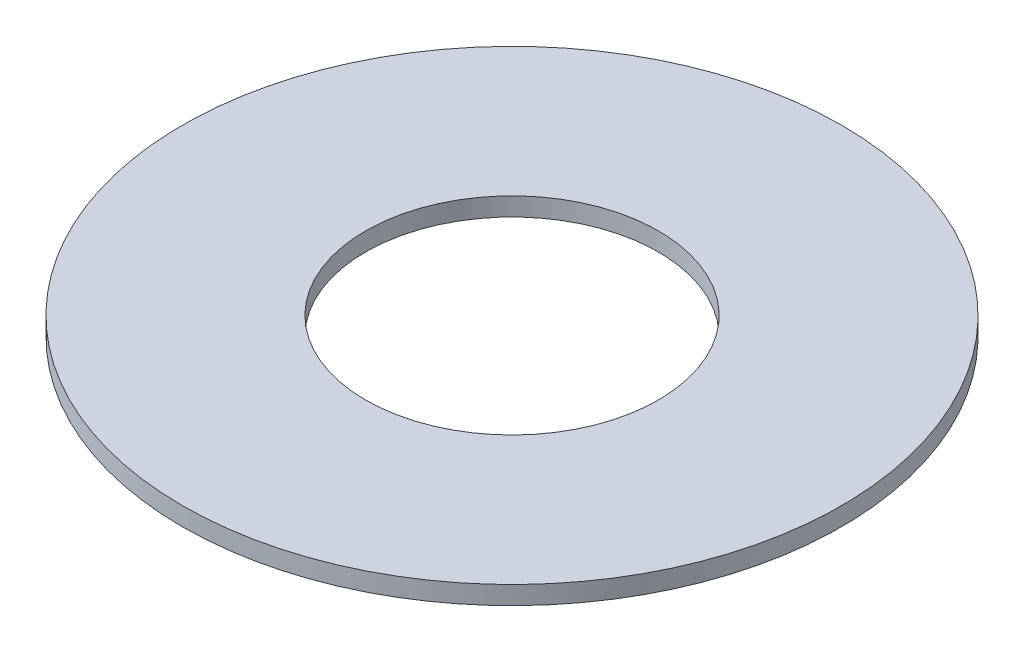
ISO-10303-21;
HEADER;
FILE_DESCRIPTION(('STEP AP214'),'2;1');
FILE_NAME('part.step','',(''),(''),'','','');
FILE_SCHEMA(('AUTOMOTIVE_DESIGN { 1 0 10303 214 1 1 1 1 }'));
ENDSEC;
DATA;
#1=APPLICATION_CONTEXT('core data for automotive mechanical design processes');
#2=APPLICATION_PROTOCOL_DEFINITION('international standard','automotive_design',2000,#1);
#3=PRODUCT_CONTEXT('',#1,'mechanical');
#4=PRODUCT('Part','Part','',(#3));
#5=PRODUCT_RELATED_PRODUCT_CATEGORY('part','',(#4));
#6=PRODUCT_DEFINITION_FORMATION('','',#4);
#7=PRODUCT_DEFINITION_CONTEXT('part definition',#1,'design');
#8=PRODUCT_DEFINITION('design','',#6,#7);
#9=PRODUCT_DEFINITION_SHAPE('','',#8);
#10=(LENGTH_UNIT() NAMED_UNIT(*) SI_UNIT(.MILLI.,.METRE.));
#11=(NAMED_UNIT(*) PLANE_ANGLE_UNIT() SI_UNIT($,.RADIAN.));
#12=(NAMED_UNIT(*) SI_UNIT($,.STERADIAN.) SOLID_ANGLE_UNIT());
#13=UNCERTAINTY_MEASURE_WITH_UNIT(LENGTH_MEASURE(1.E-05),#10,'distance_accuracy_value','');
#14=(GEOMETRIC_REPRESENTATION_CONTEXT(3) GLOBAL_UNCERTAINTY_ASSIGNED_CONTEXT((#13)) GLOBAL_UNIT_ASSIGNED_CONTEXT((#10,
#11,#12)) REPRESENTATION_CONTEXT('',''));
#15=CARTESIAN_POINT('',(0.,0.,0.));
#16=DIRECTION('',(0.,0.,1.));
#17=DIRECTION('',(1.,0.,0.));
#18=AXIS2_PLACEMENT_3D('',#15,#16,#17);
#19=CARTESIAN_POINT('',(0.,0.5,0.));
#20=DIRECTION('',(0.,1.,0.));
#21=DIRECTION('',(0.,0.,1.));
#22=AXIS2_PLACEMENT_3D('',#19,#20,#21);
#23=PLANE('',#22);
#24=CARTESIAN_POINT('',(0.,0.5,0.));
#25=DIRECTION('',(0.,1.,0.));
#26=DIRECTION('',(0.,0.,1.));
#27=AXIS2_PLACEMENT_3D('',#24,#25,#26);
#28=CIRCLE('',#27,9.);
#29=CARTESIAN_POINT('',(0.,0.5,9.));
#30=VERTEX_POINT('',#29);
#31=EDGE_CURVE('E10',#30,#30,#28,.T.);
#32=ORIENTED_EDGE('',*,*,#31,.T.);
#33=EDGE_LOOP('',(#32));
#34=FACE_BOUND('',#33,.T.);
#35=CARTESIAN_POINT('',(0.,0.5,0.));
#36=DIRECTION('',(0.,1.,0.));
#37=DIRECTION('',(0.,0.,1.));
#38=AXIS2_PLACEMENT_3D('',#35,#36,#37);
#39=CIRCLE('',#38,4.);
#40=CARTESIAN_POINT('',(0.,0.5,4.));
#41=VERTEX_POINT('',#40);
#42=EDGE_CURVE('E46',#41,#41,#39,.T.);
#43=ORIENTED_EDGE('',*,*,#42,.F.);
#44=EDGE_LOOP('',(#43));
#45=FACE_BOUND('',#44,.T.);
#46=ADVANCED_FACE('F35',(#34,#45),#23,.T.);
#47=CARTESIAN_POINT('',(0.,0.,0.));
#48=DIRECTION('',(0.,1.,0.));
#49=DIRECTION('',(0.,0.,1.));
#50=AXIS2_PLACEMENT_3D('',#47,#48,#49);
#51=PLANE('',#50);
#52=CARTESIAN_POINT('',(0.,0.,0.));
#53=DIRECTION('',(0.,1.,0.));
#54=DIRECTION('',(0.,0.,1.));
#55=AXIS2_PLACEMENT_3D('',#52,#53,#54);
#56=CIRCLE('',#55,9.);
#57=CARTESIAN_POINT('',(0.,0.,9.));
#58=VERTEX_POINT('',#57);
#59=EDGE_CURVE('E39',#58,#58,#56,.T.);
#60=ORIENTED_EDGE('',*,*,#59,.F.);
#61=EDGE_LOOP('',(#60));
#62=FACE_BOUND('',#61,.T.);
#63=CARTESIAN_POINT('',(0.,0.,0.));
#64=DIRECTION('',(0.,1.,0.));
#65=DIRECTION('',(0.,0.,1.));
#66=AXIS2_PLACEMENT_3D('',#63,#64,#65);
#67=CIRCLE('',#66,4.);
#68=CARTESIAN_POINT('',(0.,0.,4.));
#69=VERTEX_POINT('',#68);
#70=EDGE_CURVE('E48',#69,#69,#67,.T.);
#71=ORIENTED_EDGE('',*,*,#70,.T.);
#72=EDGE_LOOP('',(#71));
#73=FACE_BOUND('',#72,.T.);
#74=ADVANCED_FACE('F58',(#62,#73),#51,.F.);
#75=CARTESIAN_POINT('',(0.,0.5,0.));
#76=DIRECTION('',(0.,-1.,0.));
#77=DIRECTION('',(0.,0.,-1.));
#78=AXIS2_PLACEMENT_3D('',#75,#76,#77);
#79=CYLINDRICAL_SURFACE('',#78,9.);
#80=ORIENTED_EDGE('',*,*,#31,.F.);
#81=EDGE_LOOP('',(#80));
#82=FACE_BOUND('',#81,.T.);
#83=ORIENTED_EDGE('',*,*,#59,.T.);
#84=EDGE_LOOP('',(#83));
#85=FACE_BOUND('',#84,.T.);
#86=ADVANCED_FACE('F37',(#82,#85),#79,.T.);
#87=CARTESIAN_POINT('',(0.,0.5,0.));
#88=DIRECTION('',(0.,-1.,0.));
#89=DIRECTION('',(0.,0.,-1.));
#90=AXIS2_PLACEMENT_3D('',#87,#88,#89);
#91=CYLINDRICAL_SURFACE('',#90,4.);
#92=ORIENTED_EDGE('',*,*,#42,.T.);
#93=EDGE_LOOP('',(#92));
#94=FACE_BOUND('',#93,.T.);
#95=ORIENTED_EDGE('',*,*,#70,.F.);
#96=EDGE_LOOP('',(#95));
#97=FACE_BOUND('',#96,.T.);
#98=ADVANCED_FACE('F54',(#94,#97),#91,.F.);
#99=CLOSED_SHELL('',(#46,#74,#86,#98));
#100=MANIFOLD_SOLID_BREP('B2',#99);
#101=ADVANCED_BREP_SHAPE_REPRESENTATION('',(#18,#100),#14);
#102=SHAPE_DEFINITION_REPRESENTATION(#9,#101);
ENDSEC;
END-ISO-10303-21;
